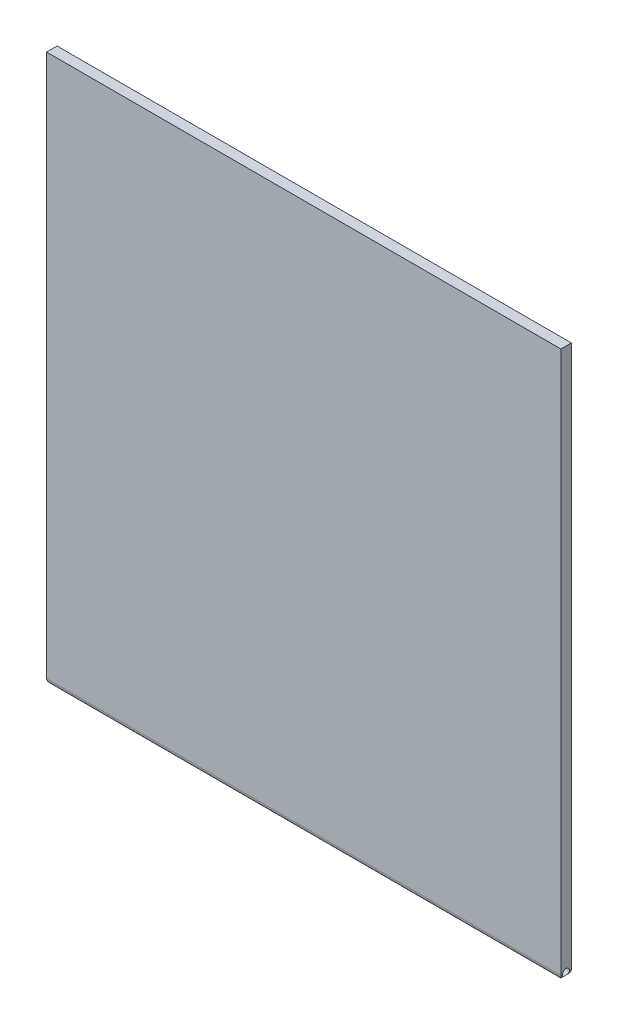
ISO-10303-21;
HEADER;
FILE_DESCRIPTION(('STEP AP214'),'2;1');
FILE_NAME('part.step','',(''),(''),'','','');
FILE_SCHEMA(('AUTOMOTIVE_DESIGN { 1 0 10303 214 1 1 1 1 }'));
ENDSEC;
DATA;
#1=APPLICATION_CONTEXT('core data for automotive mechanical design processes');
#2=APPLICATION_PROTOCOL_DEFINITION('international standard','automotive_design',2000,#1);
#3=PRODUCT_CONTEXT('',#1,'mechanical');
#4=PRODUCT('Part','Part','',(#3));
#5=PRODUCT_RELATED_PRODUCT_CATEGORY('part','',(#4));
#6=PRODUCT_DEFINITION_FORMATION('','',#4);
#7=PRODUCT_DEFINITION_CONTEXT('part definition',#1,'design');
#8=PRODUCT_DEFINITION('design','',#6,#7);
#9=PRODUCT_DEFINITION_SHAPE('','',#8);
#10=(LENGTH_UNIT() NAMED_UNIT(*) SI_UNIT(.MILLI.,.METRE.));
#11=(NAMED_UNIT(*) PLANE_ANGLE_UNIT() SI_UNIT($,.RADIAN.));
#12=(NAMED_UNIT(*) SI_UNIT($,.STERADIAN.) SOLID_ANGLE_UNIT());
#13=UNCERTAINTY_MEASURE_WITH_UNIT(LENGTH_MEASURE(1.E-05),#10,'distance_accuracy_value','');
#14=(GEOMETRIC_REPRESENTATION_CONTEXT(3) GLOBAL_UNCERTAINTY_ASSIGNED_CONTEXT((#13)) GLOBAL_UNIT_ASSIGNED_CONTEXT((#10,
#11,#12)) REPRESENTATION_CONTEXT('',''));
#15=CARTESIAN_POINT('',(0.,0.,0.));
#16=DIRECTION('',(0.,0.,1.));
#17=DIRECTION('',(1.,0.,0.));
#18=AXIS2_PLACEMENT_3D('',#15,#16,#17);
#19=CARTESIAN_POINT('',(38.5021666666666,111.411635220126,3.));
#20=DIRECTION('',(-1.,0.,0.));
#21=DIRECTION('',(0.,-1.,0.));
#22=AXIS2_PLACEMENT_3D('',#19,#20,#21);
#23=PLANE('',#22);
#24=DIRECTION('',(0.,1.,0.));
#25=VECTOR('',#24,1.);
#26=CARTESIAN_POINT('',(38.5021666666666,111.411635220126,3.));
#27=LINE('',#26,#25);
#28=CARTESIAN_POINT('',(38.5021666666666,-43.9883647798742,3.));
#29=VERTEX_POINT('',#28);
#30=CARTESIAN_POINT('',(38.5021666666666,111.411635220126,3.));
#31=VERTEX_POINT('',#30);
#32=EDGE_CURVE('E143',#29,#31,#27,.T.);
#33=ORIENTED_EDGE('',*,*,#32,.F.);
#34=DIRECTION('',(0.,0.,-1.));
#35=VECTOR('',#34,1.);
#36=CARTESIAN_POINT('',(38.5021666666666,-43.9883647798742,3.));
#37=LINE('',#36,#35);
#38=CARTESIAN_POINT('',(38.5021666666666,-43.9883647798742,2.5));
#39=VERTEX_POINT('',#38);
#40=EDGE_CURVE('E43',#29,#39,#37,.T.);
#41=ORIENTED_EDGE('',*,*,#40,.T.);
#42=CARTESIAN_POINT('',(38.5021666666666,-43.9883647798742,1.5));
#43=DIRECTION('',(1.,0.,0.));
#44=DIRECTION('',(0.,1.,0.));
#45=AXIS2_PLACEMENT_3D('',#42,#43,#44);
#46=CIRCLE('',#45,1.);
#47=CARTESIAN_POINT('',(38.5021666666666,-43.9883647798742,0.5));
#48=VERTEX_POINT('',#47);
#49=EDGE_CURVE('E103',#48,#39,#46,.T.);
#50=ORIENTED_EDGE('',*,*,#49,.F.);
#51=DIRECTION('',(0.,0.,-1.));
#52=VECTOR('',#51,1.);
#53=CARTESIAN_POINT('',(38.5021666666666,-43.9883647798742,3.));
#54=LINE('',#53,#52);
#55=CARTESIAN_POINT('',(38.5021666666666,-43.9883647798742,0.));
#56=VERTEX_POINT('',#55);
#57=EDGE_CURVE('E52',#48,#56,#54,.T.);
#58=ORIENTED_EDGE('',*,*,#57,.T.);
#59=DIRECTION('',(0.,1.,0.));
#60=VECTOR('',#59,1.);
#61=CARTESIAN_POINT('',(38.5021666666666,111.411635220126,0.));
#62=LINE('',#61,#60);
#63=CARTESIAN_POINT('',(38.5021666666666,111.411635220126,0.));
#64=VERTEX_POINT('',#63);
#65=EDGE_CURVE('E75',#56,#64,#62,.T.);
#66=ORIENTED_EDGE('',*,*,#65,.T.);
#67=DIRECTION('',(0.,0.,-1.));
#68=VECTOR('',#67,1.);
#69=CARTESIAN_POINT('',(38.5021666666666,111.411635220126,3.));
#70=LINE('',#69,#68);
#71=EDGE_CURVE('E151',#31,#64,#70,.T.);
#72=ORIENTED_EDGE('',*,*,#71,.F.);
#73=EDGE_LOOP('',(#33,#41,#50,#58,#66,#72));
#74=FACE_BOUND('',#73,.T.);
#75=ADVANCED_FACE('F32',(#74),#23,.F.);
#76=CARTESIAN_POINT('',(-108.797833333333,111.411635220126,3.));
#77=DIRECTION('',(0.,-1.,0.));
#78=DIRECTION('',(0.,0.,-1.));
#79=AXIS2_PLACEMENT_3D('',#76,#77,#78);
#80=PLANE('',#79);
#81=DIRECTION('',(-1.,0.,0.));
#82=VECTOR('',#81,1.);
#83=CARTESIAN_POINT('',(-108.797833333333,111.411635220126,0.));
#84=LINE('',#83,#82);
#85=CARTESIAN_POINT('',(-108.797833333333,111.411635220126,0.));
#86=VERTEX_POINT('',#85);
#87=EDGE_CURVE('E144',#64,#86,#84,.T.);
#88=ORIENTED_EDGE('',*,*,#87,.T.);
#89=DIRECTION('',(0.,0.,-1.));
#90=VECTOR('',#89,1.);
#91=CARTESIAN_POINT('',(-108.797833333333,111.411635220126,3.));
#92=LINE('',#91,#90);
#93=CARTESIAN_POINT('',(-108.797833333333,111.411635220126,3.));
#94=VERTEX_POINT('',#93);
#95=EDGE_CURVE('E142',#94,#86,#92,.T.);
#96=ORIENTED_EDGE('',*,*,#95,.F.);
#97=DIRECTION('',(-1.,0.,0.));
#98=VECTOR('',#97,1.);
#99=CARTESIAN_POINT('',(-108.797833333333,111.411635220126,3.));
#100=LINE('',#99,#98);
#101=EDGE_CURVE('E254',#31,#94,#100,.T.);
#102=ORIENTED_EDGE('',*,*,#101,.F.);
#103=ORIENTED_EDGE('',*,*,#71,.T.);
#104=EDGE_LOOP('',(#88,#96,#102,#103));
#105=FACE_BOUND('',#104,.T.);
#106=ADVANCED_FACE('F175',(#105),#80,.F.);
#107=CARTESIAN_POINT('',(-108.797833333333,111.411635220126,3.));
#108=DIRECTION('',(1.,0.,0.));
#109=DIRECTION('',(0.,1.,0.));
#110=AXIS2_PLACEMENT_3D('',#107,#108,#109);
#111=PLANE('',#110);
#112=DIRECTION('',(0.,-1.,0.));
#113=VECTOR('',#112,1.);
#114=CARTESIAN_POINT('',(-108.797833333333,111.411635220126,0.));
#115=LINE('',#114,#113);
#116=CARTESIAN_POINT('',(-108.797833333333,-43.9883647798742,0.));
#117=VERTEX_POINT('',#116);
#118=EDGE_CURVE('E132',#86,#117,#115,.T.);
#119=ORIENTED_EDGE('',*,*,#118,.T.);
#120=DIRECTION('',(0.,0.,-1.));
#121=VECTOR('',#120,1.);
#122=CARTESIAN_POINT('',(-108.797833333333,-43.9883647798742,3.));
#123=LINE('',#122,#121);
#124=CARTESIAN_POINT('',(-108.797833333333,-43.9883647798742,0.5));
#125=VERTEX_POINT('',#124);
#126=EDGE_CURVE('E105',#117,#125,#123,.F.);
#127=ORIENTED_EDGE('',*,*,#126,.T.);
#128=CARTESIAN_POINT('',(-108.797833333333,-43.9883647798742,1.5));
#129=DIRECTION('',(1.,0.,0.));
#130=DIRECTION('',(0.,1.,0.));
#131=AXIS2_PLACEMENT_3D('',#128,#129,#130);
#132=CIRCLE('',#131,1.);
#133=CARTESIAN_POINT('',(-108.797833333333,-43.9883647798742,2.5));
#134=VERTEX_POINT('',#133);
#135=EDGE_CURVE('E108',#125,#134,#132,.T.);
#136=ORIENTED_EDGE('',*,*,#135,.T.);
#137=DIRECTION('',(0.,0.,-1.));
#138=VECTOR('',#137,1.);
#139=CARTESIAN_POINT('',(-108.797833333333,-43.9883647798742,3.));
#140=LINE('',#139,#138);
#141=CARTESIAN_POINT('',(-108.797833333333,-43.9883647798742,3.));
#142=VERTEX_POINT('',#141);
#143=EDGE_CURVE('E149',#134,#142,#140,.F.);
#144=ORIENTED_EDGE('',*,*,#143,.T.);
#145=DIRECTION('',(0.,-1.,0.));
#146=VECTOR('',#145,1.);
#147=CARTESIAN_POINT('',(-108.797833333333,111.411635220126,3.));
#148=LINE('',#147,#146);
#149=EDGE_CURVE('E252',#94,#142,#148,.T.);
#150=ORIENTED_EDGE('',*,*,#149,.F.);
#151=ORIENTED_EDGE('',*,*,#95,.T.);
#152=EDGE_LOOP('',(#119,#127,#136,#144,#150,#151));
#153=FACE_BOUND('',#152,.T.);
#154=ADVANCED_FACE('F137',(#153),#111,.F.);
#155=CARTESIAN_POINT('',(38.5021666666666,-45.4883647798742,3.));
#156=DIRECTION('',(0.,0.,1.));
#157=DIRECTION('',(1.,0.,0.));
#158=AXIS2_PLACEMENT_3D('',#155,#156,#157);
#159=PLANE('',#158);
#160=ORIENTED_EDGE('',*,*,#149,.T.);
#161=DIRECTION('',(1.,0.,0.));
#162=VECTOR('',#161,1.);
#163=CARTESIAN_POINT('',(38.5021666666666,-43.9883647798742,3.));
#164=LINE('',#163,#162);
#165=EDGE_CURVE('E112',#142,#29,#164,.T.);
#166=ORIENTED_EDGE('',*,*,#165,.T.);
#167=ORIENTED_EDGE('',*,*,#32,.T.);
#168=ORIENTED_EDGE('',*,*,#101,.T.);
#169=EDGE_LOOP('',(#160,#166,#167,#168));
#170=FACE_BOUND('',#169,.T.);
#171=ADVANCED_FACE('F166',(#170),#159,.T.);
#172=CARTESIAN_POINT('',(38.5021666666666,-45.4883647798742,0.));
#173=DIRECTION('',(0.,0.,1.));
#174=DIRECTION('',(1.,0.,0.));
#175=AXIS2_PLACEMENT_3D('',#172,#173,#174);
#176=PLANE('',#175);
#177=ORIENTED_EDGE('',*,*,#65,.F.);
#178=DIRECTION('',(1.,0.,0.));
#179=VECTOR('',#178,1.);
#180=CARTESIAN_POINT('',(38.5021666666666,-43.9883647798742,0.));
#181=LINE('',#180,#179);
#182=EDGE_CURVE('E11',#56,#117,#181,.F.);
#183=ORIENTED_EDGE('',*,*,#182,.T.);
#184=ORIENTED_EDGE('',*,*,#118,.F.);
#185=ORIENTED_EDGE('',*,*,#87,.F.);
#186=EDGE_LOOP('',(#177,#183,#184,#185));
#187=FACE_BOUND('',#186,.T.);
#188=ADVANCED_FACE('F131',(#187),#176,.F.);
#189=CARTESIAN_POINT('',(-108.797833333333,-43.9883647798742,1.5));
#190=DIRECTION('',(1.,0.,0.));
#191=DIRECTION('',(0.,1.,0.));
#192=AXIS2_PLACEMENT_3D('',#189,#190,#191);
#193=CYLINDRICAL_SURFACE('',#192,1.);
#194=ORIENTED_EDGE('',*,*,#135,.F.);
#195=CARTESIAN_POINT('',(-108.797833333333,-43.9883647798742,0.5));
#196=CARTESIAN_POINT('',(-108.797836403667,-44.0135877707287,0.499997867518112));
#197=CARTESIAN_POINT('',(-108.797196485981,-44.0387965563487,0.500955006285135));
#198=CARTESIAN_POINT('',(-108.7946645351,-44.0889938927852,0.50475800125227));
#199=CARTESIAN_POINT('',(-108.792773213177,-44.1139825605414,0.507602784555792));
#200=CARTESIAN_POINT('',(-108.785306649123,-44.1880280254412,0.518872901166747));
#201=CARTESIAN_POINT('',(-108.77793779937,-44.2365209622762,0.530034968480587));
#202=CARTESIAN_POINT('',(-108.759091180111,-44.3304523798208,0.55904581299394));
#203=CARTESIAN_POINT('',(-108.747621044409,-44.3758963502305,0.576882170056046));
#204=CARTESIAN_POINT('',(-108.721480814737,-44.4630224055458,0.618504353085409));
#205=CARTESIAN_POINT('',(-108.706806614889,-44.504699565642,0.642297818637026));
#206=CARTESIAN_POINT('',(-108.673968879833,-44.587010592761,0.697330342244541));
#207=CARTESIAN_POINT('',(-108.655615469023,-44.6272602787021,0.729027998340156));
#208=CARTESIAN_POINT('',(-108.617742406778,-44.7022330465615,0.797869763796868));
#209=CARTESIAN_POINT('',(-108.598221251183,-44.7369487798575,0.835020991416818));
#210=CARTESIAN_POINT('',(-108.556474500126,-44.8054765873207,0.9205265055304));
#211=CARTESIAN_POINT('',(-108.534308360631,-44.8382811897535,0.969723519263272));
#212=CARTESIAN_POINT('',(-108.493253803991,-44.8951168877637,1.07418246737636));
#213=CARTESIAN_POINT('',(-108.474359703614,-44.9191632773764,1.12943360804368));
#214=CARTESIAN_POINT('',(-108.447714722657,-44.9517348888067,1.22835543783302));
#215=CARTESIAN_POINT('',(-108.438321567798,-44.9627369052442,1.27076379556298));
#216=CARTESIAN_POINT('',(-108.424123230961,-44.9791178131389,1.35737180373004));
#217=CARTESIAN_POINT('',(-108.419310188059,-44.9845063406339,1.40156824878875));
#218=CARTESIAN_POINT('',(-108.41501636143,-44.9893216006764,1.49073738528009));
#219=CARTESIAN_POINT('',(-108.415557345982,-44.9887239948228,1.53571250285994));
#220=CARTESIAN_POINT('',(-108.421932209619,-44.981552687614,1.62481747781066));
#221=CARTESIAN_POINT('',(-108.427770573903,-44.9749739221064,1.66894658654439));
#222=CARTESIAN_POINT('',(-108.443469299949,-44.9566897089033,1.75323372231664));
#223=CARTESIAN_POINT('',(-108.453140867511,-44.9452232298917,1.79348105252588));
#224=CARTESIAN_POINT('',(-108.475381568301,-44.9177152170172,1.87151220729678));
#225=CARTESIAN_POINT('',(-108.487951627136,-44.9016722212955,1.90929523995188));
#226=CARTESIAN_POINT('',(-108.517654228258,-44.8617340006478,1.98951246213652));
#227=CARTESIAN_POINT('',(-108.535194733912,-44.8369053492664,2.03132949903384));
#228=CARTESIAN_POINT('',(-108.571290824326,-44.7817098655384,2.11069129880162));
#229=CARTESIAN_POINT('',(-108.589847651446,-44.7513361440863,2.1482306518551));
#230=CARTESIAN_POINT('',(-108.630548390226,-44.6782737747144,2.22626807907495));
#231=CARTESIAN_POINT('',(-108.652603766666,-44.6343417826538,2.26566111537734));
#232=CARTESIAN_POINT('',(-108.693920965771,-44.539375629112,2.33659357628644));
#233=CARTESIAN_POINT('',(-108.713184985881,-44.4883471169451,2.36813919280999));
#234=CARTESIAN_POINT('',(-108.74356927604,-44.3907672753804,2.41675305649799));
#235=CARTESIAN_POINT('',(-108.755545388183,-44.3452913495888,2.43544599928697));
#236=CARTESIAN_POINT('',(-108.775382479849,-44.2513105672716,2.46606874152582));
#237=CARTESIAN_POINT('',(-108.783252314712,-44.202812483293,2.47801309920034));
#238=CARTESIAN_POINT('',(-108.791727931771,-44.1263121992924,2.49082378582502));
#239=CARTESIAN_POINT('',(-108.794008811369,-44.0988971079727,2.49425634231903));
#240=CARTESIAN_POINT('',(-108.797064460363,-44.0437820628922,2.49884694853535));
#241=CARTESIAN_POINT('',(-108.797838548074,-44.016081985896,2.5000039687918));
#242=CARTESIAN_POINT('',(-108.797833333333,-43.9883647798742,2.5));
#243=B_SPLINE_CURVE_WITH_KNOTS('',3,(#195,#196,#197,#198,#199,#200,#201,#202,#203,#204,#205,
#206,#207,#208,#209,#210,#211,#212,#213,#214,#215,#216,#217,#218,#219,#220,#221,#222,#223,#224,
#225,#226,#227,#228,#229,#230,#231,#232,#233,#234,#235,#236,#237,#238,#239,#240,#241,#242),
.UNSPECIFIED.,.F.,.F.,(4,2,2,2,2,2,2,2,2,2,2,2,2,2,2,2,2,2,2,2,2,2,2,4),(0.,0.0756155393796793,
0.151188137283857,0.301278773145144,0.451091484295536,0.601097313024803,0.763749621107992,
0.926616150140277,1.11518883123061,1.30343062019747,1.4373218843141,1.57098293189718,
1.70518763798528,1.83950607898822,1.96789901619186,2.09633301145895,2.25089113961451,
2.4056426114595,2.59373489293889,2.78167828822827,2.93287425225027,3.08374279470928,
3.16678966855174,3.24987410464925),.UNSPECIFIED.);
#244=EDGE_CURVE('E104',#125,#134,#243,.T.);
#245=ORIENTED_EDGE('',*,*,#244,.T.);
#246=EDGE_LOOP('',(#194,#245));
#247=FACE_BOUND('',#246,.T.);
#248=ORIENTED_EDGE('',*,*,#49,.T.);
#249=CARTESIAN_POINT('',(38.5021666666666,-43.9883647798742,2.5));
#250=CARTESIAN_POINT('',(38.5021697370006,-44.0135877707287,2.50000213248189));
#251=CARTESIAN_POINT('',(38.5015298193146,-44.0387965563487,2.49904499371486));
#252=CARTESIAN_POINT('',(38.4989978684331,-44.0889938927852,2.49524199874773));
#253=CARTESIAN_POINT('',(38.4971065465106,-44.1139825605414,2.49239721544421));
#254=CARTESIAN_POINT('',(38.4896399824565,-44.1880280254412,2.48112709883325));
#255=CARTESIAN_POINT('',(38.4822711327037,-44.2365209622762,2.46996503151941));
#256=CARTESIAN_POINT('',(38.4634245134441,-44.3304523798208,2.44095418700605));
#257=CARTESIAN_POINT('',(38.451954377742,-44.3758963502305,2.42311782994395));
#258=CARTESIAN_POINT('',(38.4258141480704,-44.4630224055458,2.38149564691458));
#259=CARTESIAN_POINT('',(38.4111399482221,-44.504699565642,2.35770218136296));
#260=CARTESIAN_POINT('',(38.3783022131663,-44.587010592761,2.30266965775544));
#261=CARTESIAN_POINT('',(38.3599488023562,-44.6272602787021,2.27097200165983));
#262=CARTESIAN_POINT('',(38.3220757401109,-44.7022330465615,2.20213023620311));
#263=CARTESIAN_POINT('',(38.3025545845166,-44.7369487798575,2.16497900858316));
#264=CARTESIAN_POINT('',(38.260807833459,-44.8054765873207,2.07947349446958));
#265=CARTESIAN_POINT('',(38.2386416939642,-44.8382811897535,2.03027648073671));
#266=CARTESIAN_POINT('',(38.1975871373244,-44.8951168877637,1.92581753262362));
#267=CARTESIAN_POINT('',(38.1786930369471,-44.9191632773764,1.8705663919563));
#268=CARTESIAN_POINT('',(38.1520480559902,-44.9517348888067,1.77164456216696));
#269=CARTESIAN_POINT('',(38.1426549011314,-44.9627369052441,1.72923620443699));
#270=CARTESIAN_POINT('',(38.1284565642945,-44.9791178131388,1.64262819626993));
#271=CARTESIAN_POINT('',(38.1236435213927,-44.9845063406339,1.59843175121122));
#272=CARTESIAN_POINT('',(38.1193496947629,-44.9893216006764,1.50926261471988));
#273=CARTESIAN_POINT('',(38.1198906793149,-44.9887239948227,1.46428749714003));
#274=CARTESIAN_POINT('',(38.1262655429524,-44.981552687614,1.37518252218931));
#275=CARTESIAN_POINT('',(38.1321039072365,-44.9749739221064,1.33105341345559));
#276=CARTESIAN_POINT('',(38.1478026332822,-44.9566897089033,1.24676627768334));
#277=CARTESIAN_POINT('',(38.1574742008441,-44.9452232298917,1.20651894747409));
#278=CARTESIAN_POINT('',(38.1797149016339,-44.9177152170171,1.12848779270319));
#279=CARTESIAN_POINT('',(38.1922849604691,-44.9016722212954,1.09070476004809));
#280=CARTESIAN_POINT('',(38.2219875615915,-44.8617340006477,1.01048753786345));
#281=CARTESIAN_POINT('',(38.2395280672452,-44.8369053492664,0.968670500966134));
#282=CARTESIAN_POINT('',(38.2756241576593,-44.7817098655383,0.889308701198352));
#283=CARTESIAN_POINT('',(38.2941809847791,-44.7513361440863,0.851769348144872));
#284=CARTESIAN_POINT('',(38.3348817235589,-44.6782737747143,0.773731920925017));
#285=CARTESIAN_POINT('',(38.3569370999988,-44.6343417826538,0.734338884622624));
#286=CARTESIAN_POINT('',(38.3982542991045,-44.539375629112,0.66340642371353));
#287=CARTESIAN_POINT('',(38.4175183192146,-44.4883471169451,0.631860807189987));
#288=CARTESIAN_POINT('',(38.4479026093731,-44.3907672753803,0.583246943501988));
#289=CARTESIAN_POINT('',(38.4598787215165,-44.3452913495887,0.56455400071301));
#290=CARTESIAN_POINT('',(38.4797158131827,-44.2513105672715,0.53393125847416));
#291=CARTESIAN_POINT('',(38.4875856480448,-44.2028124832929,0.521986900799652));
#292=CARTESIAN_POINT('',(38.4960612651039,-44.1263121992923,0.509176214174972));
#293=CARTESIAN_POINT('',(38.4983421447027,-44.0988971079727,0.505743657680968));
#294=CARTESIAN_POINT('',(38.5013977936958,-44.0437820628922,0.501153051464654));
#295=CARTESIAN_POINT('',(38.502171881407,-44.0160819858959,0.499996031208196));
#296=CARTESIAN_POINT('',(38.5021666666666,-43.9883647798742,0.5));
#297=B_SPLINE_CURVE_WITH_KNOTS('',3,(#249,#250,#251,#252,#253,#254,#255,#256,#257,#258,#259,
#260,#261,#262,#263,#264,#265,#266,#267,#268,#269,#270,#271,#272,#273,#274,#275,#276,#277,#278,
#279,#280,#281,#282,#283,#284,#285,#286,#287,#288,#289,#290,#291,#292,#293,#294,#295,#296),
.UNSPECIFIED.,.F.,.F.,(4,2,2,2,2,2,2,2,2,2,2,2,2,2,2,2,2,2,2,2,2,2,2,4),(0.,0.0756155393796785,
0.151188137283857,0.301278773145145,0.451091484295538,0.601097313024805,0.763749621107999,
0.926616150140281,1.11518883123061,1.30343062019747,1.4373218843141,1.57098293189718,
1.70518763798529,1.83950607898822,1.96789901619186,2.09633301145896,2.25089113961452,
2.40564261145952,2.59373489293892,2.78167828822829,2.9328742522503,3.0837427947093,
3.16678966855173,3.2498741046492),.UNSPECIFIED.);
#298=EDGE_CURVE('E101',#39,#48,#297,.T.);
#299=ORIENTED_EDGE('',*,*,#298,.T.);
#300=EDGE_LOOP('',(#248,#299));
#301=FACE_BOUND('',#300,.T.);
#302=ADVANCED_FACE('F102',(#247,#301),#193,.F.);
#303=CARTESIAN_POINT('',(37.0021666666666,-43.9883647798742,3.));
#304=DIRECTION('',(0.,0.,-1.));
#305=DIRECTION('',(-1.,0.,0.));
#306=AXIS2_PLACEMENT_3D('',#303,#304,#305);
#307=CYLINDRICAL_SURFACE('',#306,1.5);
#308=ORIENTED_EDGE('',*,*,#298,.F.);
#309=ORIENTED_EDGE('',*,*,#40,.F.);
#310=CARTESIAN_POINT('',(37.0021666666666,-43.9883647798742,1.5));
#311=DIRECTION('',(0.707106781186547,0.,-0.707106781186547));
#312=DIRECTION('',(-0.707106781186547,0.,-0.707106781186547));
#313=AXIS2_PLACEMENT_3D('',#310,#311,#312);
#314=ELLIPSE('',#313,2.12132034355964,1.5);
#315=CARTESIAN_POINT('',(37.0021666666666,-45.4883647798742,1.5));
#316=VERTEX_POINT('',#315);
#317=EDGE_CURVE('E37',#316,#29,#314,.F.);
#318=ORIENTED_EDGE('',*,*,#317,.F.);
#319=CARTESIAN_POINT('',(37.0021666666666,-43.9883647798742,1.5));
#320=DIRECTION('',(0.707106781186547,0.,0.707106781186547));
#321=DIRECTION('',(0.707106781186547,0.,-0.707106781186547));
#322=AXIS2_PLACEMENT_3D('',#319,#320,#321);
#323=ELLIPSE('',#322,2.12132034355964,1.5);
#324=EDGE_CURVE('E110',#56,#316,#323,.F.);
#325=ORIENTED_EDGE('',*,*,#324,.F.);
#326=ORIENTED_EDGE('',*,*,#57,.F.);
#327=EDGE_LOOP('',(#308,#309,#318,#325,#326));
#328=FACE_BOUND('',#327,.T.);
#329=ADVANCED_FACE('F34',(#328),#307,.T.);
#330=CARTESIAN_POINT('',(38.5021666666666,-43.9883647798742,1.5));
#331=DIRECTION('',(-1.,0.,0.));
#332=DIRECTION('',(0.,0.,1.));
#333=AXIS2_PLACEMENT_3D('',#330,#331,#332);
#334=CYLINDRICAL_SURFACE('',#333,1.5);
#335=DIRECTION('',(1.,0.,0.));
#336=VECTOR('',#335,1.);
#337=CARTESIAN_POINT('',(-108.797833333333,-45.4883647798742,1.5));
#338=LINE('',#337,#336);
#339=CARTESIAN_POINT('',(-107.297833333333,-45.4883647798742,1.5));
#340=VERTEX_POINT('',#339);
#341=EDGE_CURVE('E64',#316,#340,#338,.F.);
#342=ORIENTED_EDGE('',*,*,#341,.F.);
#343=ORIENTED_EDGE('',*,*,#317,.T.);
#344=ORIENTED_EDGE('',*,*,#165,.F.);
#345=CARTESIAN_POINT('',(-107.297833333333,-43.9883647798742,1.5));
#346=DIRECTION('',(-0.707106781186547,0.,-0.707106781186547));
#347=DIRECTION('',(-0.707106781186547,0.,0.707106781186547));
#348=AXIS2_PLACEMENT_3D('',#345,#346,#347);
#349=ELLIPSE('',#348,2.12132034355964,1.5);
#350=EDGE_CURVE('E121',#340,#142,#349,.T.);
#351=ORIENTED_EDGE('',*,*,#350,.F.);
#352=EDGE_LOOP('',(#342,#343,#344,#351));
#353=FACE_BOUND('',#352,.T.);
#354=ADVANCED_FACE('F126',(#353),#334,.T.);
#355=CARTESIAN_POINT('',(-108.797833333333,-43.9883647798742,1.5));
#356=DIRECTION('',(1.,0.,0.));
#357=DIRECTION('',(0.,0.,-1.));
#358=AXIS2_PLACEMENT_3D('',#355,#356,#357);
#359=CYLINDRICAL_SURFACE('',#358,1.5);
#360=ORIENTED_EDGE('',*,*,#324,.T.);
#361=ORIENTED_EDGE('',*,*,#341,.T.);
#362=CARTESIAN_POINT('',(-107.297833333333,-43.9883647798742,1.5));
#363=DIRECTION('',(0.707106781186547,0.,-0.707106781186547));
#364=DIRECTION('',(0.707106781186547,0.,0.707106781186547));
#365=AXIS2_PLACEMENT_3D('',#362,#363,#364);
#366=ELLIPSE('',#365,2.12132034355964,1.5);
#367=EDGE_CURVE('E118',#117,#340,#366,.F.);
#368=ORIENTED_EDGE('',*,*,#367,.F.);
#369=ORIENTED_EDGE('',*,*,#182,.F.);
#370=EDGE_LOOP('',(#360,#361,#368,#369));
#371=FACE_BOUND('',#370,.T.);
#372=ADVANCED_FACE('F127',(#371),#359,.T.);
#373=CARTESIAN_POINT('',(-107.297833333333,-43.9883647798742,3.));
#374=DIRECTION('',(0.,0.,-1.));
#375=DIRECTION('',(-1.,0.,0.));
#376=AXIS2_PLACEMENT_3D('',#373,#374,#375);
#377=CYLINDRICAL_SURFACE('',#376,1.5);
#378=ORIENTED_EDGE('',*,*,#244,.F.);
#379=ORIENTED_EDGE('',*,*,#126,.F.);
#380=ORIENTED_EDGE('',*,*,#367,.T.);
#381=ORIENTED_EDGE('',*,*,#350,.T.);
#382=ORIENTED_EDGE('',*,*,#143,.F.);
#383=EDGE_LOOP('',(#378,#379,#380,#381,#382));
#384=FACE_BOUND('',#383,.T.);
#385=ADVANCED_FACE('F147',(#384),#377,.T.);
#386=CLOSED_SHELL('',(#75,#106,#154,#171,#188,#302,#329,#354,#372,#385));
#387=MANIFOLD_SOLID_BREP('B2',#386);
#388=ADVANCED_BREP_SHAPE_REPRESENTATION('',(#18,#387),#14);
#389=SHAPE_DEFINITION_REPRESENTATION(#9,#388);
ENDSEC;
END-ISO-10303-21;
